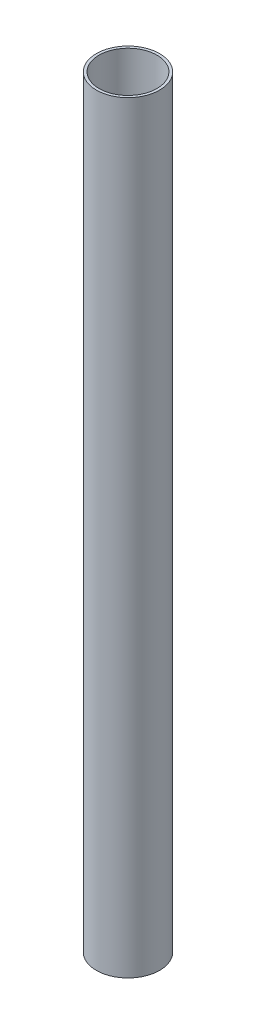
ISO-10303-21;
HEADER;
FILE_DESCRIPTION(('STEP AP214'),'2;1');
FILE_NAME('part.step','',(''),(''),'','','');
FILE_SCHEMA(('AUTOMOTIVE_DESIGN { 1 0 10303 214 1 1 1 1 }'));
ENDSEC;
DATA;
#1=APPLICATION_CONTEXT('core data for automotive mechanical design processes');
#2=APPLICATION_PROTOCOL_DEFINITION('international standard','automotive_design',2000,#1);
#3=PRODUCT_CONTEXT('',#1,'mechanical');
#4=PRODUCT('Part','Part','',(#3));
#5=PRODUCT_RELATED_PRODUCT_CATEGORY('part','',(#4));
#6=PRODUCT_DEFINITION_FORMATION('','',#4);
#7=PRODUCT_DEFINITION_CONTEXT('part definition',#1,'design');
#8=PRODUCT_DEFINITION('design','',#6,#7);
#9=PRODUCT_DEFINITION_SHAPE('','',#8);
#10=(LENGTH_UNIT() NAMED_UNIT(*) SI_UNIT(.MILLI.,.METRE.));
#11=(NAMED_UNIT(*) PLANE_ANGLE_UNIT() SI_UNIT($,.RADIAN.));
#12=(NAMED_UNIT(*) SI_UNIT($,.STERADIAN.) SOLID_ANGLE_UNIT());
#13=UNCERTAINTY_MEASURE_WITH_UNIT(LENGTH_MEASURE(1.E-05),#10,'distance_accuracy_value','');
#14=(GEOMETRIC_REPRESENTATION_CONTEXT(3) GLOBAL_UNCERTAINTY_ASSIGNED_CONTEXT((#13)) GLOBAL_UNIT_ASSIGNED_CONTEXT((#10,
#11,#12)) REPRESENTATION_CONTEXT('',''));
#15=CARTESIAN_POINT('',(0.,0.,0.));
#16=DIRECTION('',(0.,0.,1.));
#17=DIRECTION('',(1.,0.,0.));
#18=AXIS2_PLACEMENT_3D('',#15,#16,#17);
#19=CARTESIAN_POINT('',(0.,1000.,0.));
#20=DIRECTION('',(0.,1.,0.));
#21=DIRECTION('',(0.,0.,1.));
#22=AXIS2_PLACEMENT_3D('',#19,#20,#21);
#23=PLANE('',#22);
#24=CARTESIAN_POINT('',(0.,1000.,0.));
#25=DIRECTION('',(0.,1.,0.));
#26=DIRECTION('',(0.,0.,1.));
#27=AXIS2_PLACEMENT_3D('',#24,#25,#26);
#28=CIRCLE('',#27,41.5);
#29=CARTESIAN_POINT('',(0.,1000.,41.5));
#30=VERTEX_POINT('',#29);
#31=EDGE_CURVE('E10',#30,#30,#28,.T.);
#32=ORIENTED_EDGE('',*,*,#31,.T.);
#33=EDGE_LOOP('',(#32));
#34=FACE_BOUND('',#33,.T.);
#35=CARTESIAN_POINT('',(0.,1000.,0.));
#36=DIRECTION('',(0.,1.,0.));
#37=DIRECTION('',(0.,0.,1.));
#38=AXIS2_PLACEMENT_3D('',#35,#36,#37);
#39=CIRCLE('',#38,38.);
#40=CARTESIAN_POINT('',(0.,1000.,38.));
#41=VERTEX_POINT('',#40);
#42=EDGE_CURVE('E52',#41,#41,#39,.T.);
#43=ORIENTED_EDGE('',*,*,#42,.F.);
#44=EDGE_LOOP('',(#43));
#45=FACE_BOUND('',#44,.T.);
#46=ADVANCED_FACE('F41',(#34,#45),#23,.T.);
#47=CARTESIAN_POINT('',(0.,0.,0.));
#48=DIRECTION('',(0.,1.,0.));
#49=DIRECTION('',(0.,0.,1.));
#50=AXIS2_PLACEMENT_3D('',#47,#48,#49);
#51=PLANE('',#50);
#52=CARTESIAN_POINT('',(0.,0.,0.));
#53=DIRECTION('',(0.,1.,0.));
#54=DIRECTION('',(0.,0.,1.));
#55=AXIS2_PLACEMENT_3D('',#52,#53,#54);
#56=CIRCLE('',#55,41.5);
#57=CARTESIAN_POINT('',(0.,0.,41.5));
#58=VERTEX_POINT('',#57);
#59=EDGE_CURVE('E45',#58,#58,#56,.T.);
#60=ORIENTED_EDGE('',*,*,#59,.F.);
#61=EDGE_LOOP('',(#60));
#62=FACE_BOUND('',#61,.T.);
#63=CARTESIAN_POINT('',(0.,0.,0.));
#64=DIRECTION('',(0.,1.,0.));
#65=DIRECTION('',(0.,0.,1.));
#66=AXIS2_PLACEMENT_3D('',#63,#64,#65);
#67=CIRCLE('',#66,38.);
#68=CARTESIAN_POINT('',(0.,0.,38.));
#69=VERTEX_POINT('',#68);
#70=EDGE_CURVE('E54',#69,#69,#67,.T.);
#71=ORIENTED_EDGE('',*,*,#70,.T.);
#72=EDGE_LOOP('',(#71));
#73=FACE_BOUND('',#72,.T.);
#74=ADVANCED_FACE('F64',(#62,#73),#51,.F.);
#75=CARTESIAN_POINT('',(0.,1000.,0.));
#76=DIRECTION('',(0.,-1.,0.));
#77=DIRECTION('',(0.,0.,-1.));
#78=AXIS2_PLACEMENT_3D('',#75,#76,#77);
#79=CYLINDRICAL_SURFACE('',#78,41.5);
#80=ORIENTED_EDGE('',*,*,#31,.F.);
#81=EDGE_LOOP('',(#80));
#82=FACE_BOUND('',#81,.T.);
#83=ORIENTED_EDGE('',*,*,#59,.T.);
#84=EDGE_LOOP('',(#83));
#85=FACE_BOUND('',#84,.T.);
#86=ADVANCED_FACE('F43',(#82,#85),#79,.T.);
#87=CARTESIAN_POINT('',(0.,1000.,0.));
#88=DIRECTION('',(0.,-1.,0.));
#89=DIRECTION('',(0.,0.,-1.));
#90=AXIS2_PLACEMENT_3D('',#87,#88,#89);
#91=CYLINDRICAL_SURFACE('',#90,38.);
#92=ORIENTED_EDGE('',*,*,#42,.T.);
#93=EDGE_LOOP('',(#92));
#94=FACE_BOUND('',#93,.T.);
#95=ORIENTED_EDGE('',*,*,#70,.F.);
#96=EDGE_LOOP('',(#95));
#97=FACE_BOUND('',#96,.T.);
#98=ADVANCED_FACE('F60',(#94,#97),#91,.F.);
#99=CLOSED_SHELL('',(#46,#74,#86,#98));
#100=MANIFOLD_SOLID_BREP('B2',#99);
#101=ADVANCED_BREP_SHAPE_REPRESENTATION('',(#18,#100),#14);
#102=SHAPE_DEFINITION_REPRESENTATION(#9,#101);
ENDSEC;
END-ISO-10303-21;
